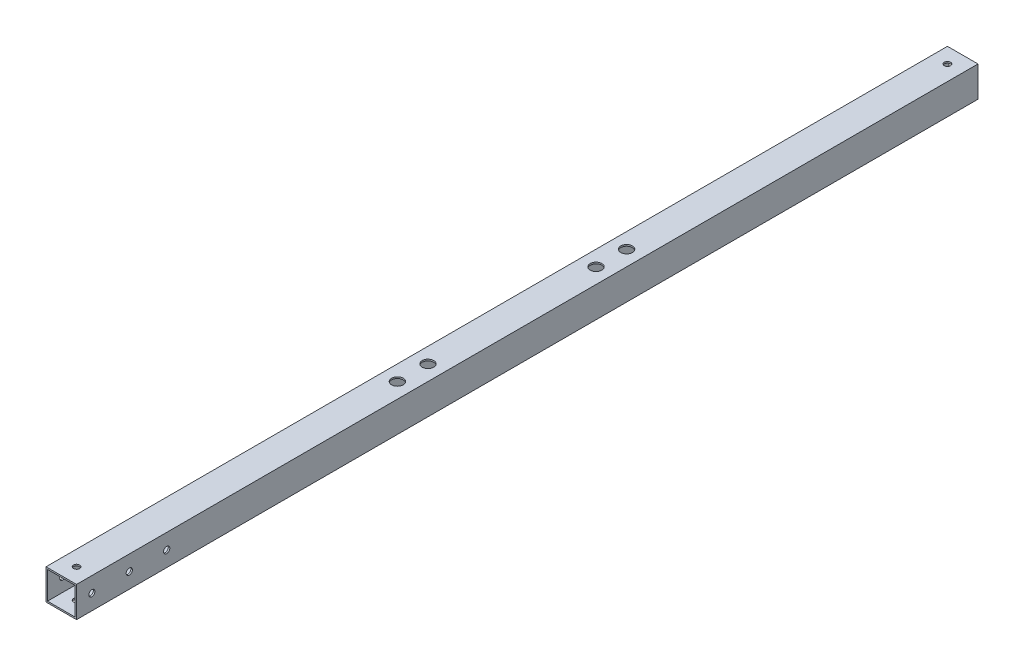
ISO-10303-21;
HEADER;
FILE_DESCRIPTION(('STEP AP214'),'2;1');
FILE_NAME('part.step','',(''),(''),'','','');
FILE_SCHEMA(('AUTOMOTIVE_DESIGN { 1 0 10303 214 1 1 1 1 }'));
ENDSEC;
DATA;
#1=APPLICATION_CONTEXT('core data for automotive mechanical design processes');
#2=APPLICATION_PROTOCOL_DEFINITION('international standard','automotive_design',2000,#1);
#3=PRODUCT_CONTEXT('',#1,'mechanical');
#4=PRODUCT('Part','Part','',(#3));
#5=PRODUCT_RELATED_PRODUCT_CATEGORY('part','',(#4));
#6=PRODUCT_DEFINITION_FORMATION('','',#4);
#7=PRODUCT_DEFINITION_CONTEXT('part definition',#1,'design');
#8=PRODUCT_DEFINITION('design','',#6,#7);
#9=PRODUCT_DEFINITION_SHAPE('','',#8);
#10=(LENGTH_UNIT() NAMED_UNIT(*) SI_UNIT(.MILLI.,.METRE.));
#11=(NAMED_UNIT(*) PLANE_ANGLE_UNIT() SI_UNIT($,.RADIAN.));
#12=(NAMED_UNIT(*) SI_UNIT($,.STERADIAN.) SOLID_ANGLE_UNIT());
#13=UNCERTAINTY_MEASURE_WITH_UNIT(LENGTH_MEASURE(1.E-05),#10,'distance_accuracy_value','');
#14=(GEOMETRIC_REPRESENTATION_CONTEXT(3) GLOBAL_UNCERTAINTY_ASSIGNED_CONTEXT((#13)) GLOBAL_UNIT_ASSIGNED_CONTEXT((#10,
#11,#12)) REPRESENTATION_CONTEXT('',''));
#15=CARTESIAN_POINT('',(0.,0.,0.));
#16=DIRECTION('',(0.,0.,1.));
#17=DIRECTION('',(1.,0.,0.));
#18=AXIS2_PLACEMENT_3D('',#15,#16,#17);
#19=CARTESIAN_POINT('',(0.,0.,295.));
#20=DIRECTION('',(0.,0.,-1.));
#21=DIRECTION('',(-1.,0.,0.));
#22=AXIS2_PLACEMENT_3D('',#19,#20,#21);
#23=PLANE('',#22);
#24=DIRECTION('',(0.,1.,0.));
#25=VECTOR('',#24,1.);
#26=CARTESIAN_POINT('',(10.,-10.,295.));
#27=LINE('',#26,#25);
#28=CARTESIAN_POINT('',(10.,-10.,295.));
#29=VERTEX_POINT('',#28);
#30=CARTESIAN_POINT('',(10.,10.,295.));
#31=VERTEX_POINT('',#30);
#32=EDGE_CURVE('E141',#29,#31,#27,.T.);
#33=ORIENTED_EDGE('',*,*,#32,.T.);
#34=DIRECTION('',(-1.,0.,0.));
#35=VECTOR('',#34,1.);
#36=CARTESIAN_POINT('',(-10.,10.,295.));
#37=LINE('',#36,#35);
#38=CARTESIAN_POINT('',(-10.,10.,295.));
#39=VERTEX_POINT('',#38);
#40=EDGE_CURVE('E144',#31,#39,#37,.T.);
#41=ORIENTED_EDGE('',*,*,#40,.T.);
#42=DIRECTION('',(0.,-1.,0.));
#43=VECTOR('',#42,1.);
#44=CARTESIAN_POINT('',(-10.,-10.,295.));
#45=LINE('',#44,#43);
#46=CARTESIAN_POINT('',(-10.,-10.,295.));
#47=VERTEX_POINT('',#46);
#48=EDGE_CURVE('E147',#39,#47,#45,.T.);
#49=ORIENTED_EDGE('',*,*,#48,.T.);
#50=DIRECTION('',(1.,0.,0.));
#51=VECTOR('',#50,1.);
#52=CARTESIAN_POINT('',(-10.,-10.,295.));
#53=LINE('',#52,#51);
#54=EDGE_CURVE('E149',#47,#29,#53,.T.);
#55=ORIENTED_EDGE('',*,*,#54,.T.);
#56=EDGE_LOOP('',(#33,#41,#49,#55));
#57=FACE_BOUND('',#56,.T.);
#58=DIRECTION('',(1.,0.,0.));
#59=VECTOR('',#58,1.);
#60=CARTESIAN_POINT('',(-9.,-9.,295.));
#61=LINE('',#60,#59);
#62=CARTESIAN_POINT('',(-9.,-9.,295.));
#63=VERTEX_POINT('',#62);
#64=CARTESIAN_POINT('',(9.,-9.,295.));
#65=VERTEX_POINT('',#64);
#66=EDGE_CURVE('E103',#63,#65,#61,.T.);
#67=ORIENTED_EDGE('',*,*,#66,.F.);
#68=DIRECTION('',(0.,-1.,0.));
#69=VECTOR('',#68,1.);
#70=CARTESIAN_POINT('',(-9.,-9.,295.));
#71=LINE('',#70,#69);
#72=CARTESIAN_POINT('',(-9.,9.,295.));
#73=VERTEX_POINT('',#72);
#74=EDGE_CURVE('E125',#73,#63,#71,.T.);
#75=ORIENTED_EDGE('',*,*,#74,.F.);
#76=DIRECTION('',(-1.,0.,0.));
#77=VECTOR('',#76,1.);
#78=CARTESIAN_POINT('',(-9.,9.,295.));
#79=LINE('',#78,#77);
#80=CARTESIAN_POINT('',(9.,9.,295.));
#81=VERTEX_POINT('',#80);
#82=EDGE_CURVE('E123',#81,#73,#79,.T.);
#83=ORIENTED_EDGE('',*,*,#82,.F.);
#84=DIRECTION('',(0.,1.,0.));
#85=VECTOR('',#84,1.);
#86=CARTESIAN_POINT('',(9.,-9.,295.));
#87=LINE('',#86,#85);
#88=EDGE_CURVE('E111',#65,#81,#87,.T.);
#89=ORIENTED_EDGE('',*,*,#88,.F.);
#90=EDGE_LOOP('',(#67,#75,#83,#89));
#91=FACE_BOUND('',#90,.T.);
#92=ADVANCED_FACE('F36',(#57,#91),#23,.F.);
#93=CARTESIAN_POINT('',(0.,0.,-295.));
#94=DIRECTION('',(0.,0.,-1.));
#95=DIRECTION('',(-1.,0.,0.));
#96=AXIS2_PLACEMENT_3D('',#93,#94,#95);
#97=PLANE('',#96);
#98=DIRECTION('',(0.,1.,0.));
#99=VECTOR('',#98,1.);
#100=CARTESIAN_POINT('',(10.,-10.,-295.));
#101=LINE('',#100,#99);
#102=CARTESIAN_POINT('',(10.,-10.,-295.));
#103=VERTEX_POINT('',#102);
#104=CARTESIAN_POINT('',(10.,10.,-295.));
#105=VERTEX_POINT('',#104);
#106=EDGE_CURVE('E119',#103,#105,#101,.T.);
#107=ORIENTED_EDGE('',*,*,#106,.F.);
#108=DIRECTION('',(1.,0.,0.));
#109=VECTOR('',#108,1.);
#110=CARTESIAN_POINT('',(-10.,-10.,-295.));
#111=LINE('',#110,#109);
#112=CARTESIAN_POINT('',(-10.,-10.,-295.));
#113=VERTEX_POINT('',#112);
#114=EDGE_CURVE('E145',#113,#103,#111,.T.);
#115=ORIENTED_EDGE('',*,*,#114,.F.);
#116=DIRECTION('',(0.,-1.,0.));
#117=VECTOR('',#116,1.);
#118=CARTESIAN_POINT('',(-10.,-10.,-295.));
#119=LINE('',#118,#117);
#120=CARTESIAN_POINT('',(-10.,10.,-295.));
#121=VERTEX_POINT('',#120);
#122=EDGE_CURVE('E156',#121,#113,#119,.T.);
#123=ORIENTED_EDGE('',*,*,#122,.F.);
#124=DIRECTION('',(-1.,0.,0.));
#125=VECTOR('',#124,1.);
#126=CARTESIAN_POINT('',(-10.,10.,-295.));
#127=LINE('',#126,#125);
#128=EDGE_CURVE('E154',#105,#121,#127,.T.);
#129=ORIENTED_EDGE('',*,*,#128,.F.);
#130=EDGE_LOOP('',(#107,#115,#123,#129));
#131=FACE_BOUND('',#130,.T.);
#132=DIRECTION('',(0.,-1.,0.));
#133=VECTOR('',#132,1.);
#134=CARTESIAN_POINT('',(-9.,-9.,-295.));
#135=LINE('',#134,#133);
#136=CARTESIAN_POINT('',(-9.,9.,-295.));
#137=VERTEX_POINT('',#136);
#138=CARTESIAN_POINT('',(-9.,-9.,-295.));
#139=VERTEX_POINT('',#138);
#140=EDGE_CURVE('E112',#137,#139,#135,.T.);
#141=ORIENTED_EDGE('',*,*,#140,.T.);
#142=DIRECTION('',(1.,0.,0.));
#143=VECTOR('',#142,1.);
#144=CARTESIAN_POINT('',(-9.,-9.,-295.));
#145=LINE('',#144,#143);
#146=CARTESIAN_POINT('',(9.,-9.,-295.));
#147=VERTEX_POINT('',#146);
#148=EDGE_CURVE('E61',#139,#147,#145,.T.);
#149=ORIENTED_EDGE('',*,*,#148,.T.);
#150=DIRECTION('',(0.,1.,0.));
#151=VECTOR('',#150,1.);
#152=CARTESIAN_POINT('',(9.,-9.,-295.));
#153=LINE('',#152,#151);
#154=CARTESIAN_POINT('',(9.,9.,-295.));
#155=VERTEX_POINT('',#154);
#156=EDGE_CURVE('E118',#147,#155,#153,.T.);
#157=ORIENTED_EDGE('',*,*,#156,.T.);
#158=DIRECTION('',(-1.,0.,0.));
#159=VECTOR('',#158,1.);
#160=CARTESIAN_POINT('',(-9.,9.,-295.));
#161=LINE('',#160,#159);
#162=EDGE_CURVE('E133',#155,#137,#161,.T.);
#163=ORIENTED_EDGE('',*,*,#162,.T.);
#164=EDGE_LOOP('',(#141,#149,#157,#163));
#165=FACE_BOUND('',#164,.T.);
#166=ADVANCED_FACE('F289',(#131,#165),#97,.T.);
#167=CARTESIAN_POINT('',(10.,-10.,295.));
#168=DIRECTION('',(-1.,0.,0.));
#169=DIRECTION('',(0.,-1.,0.));
#170=AXIS2_PLACEMENT_3D('',#167,#168,#169);
#171=PLANE('',#170);
#172=CARTESIAN_POINT('',(10.,0.,236.));
#173=DIRECTION('',(1.,0.,0.));
#174=DIRECTION('',(0.,1.,0.));
#175=AXIS2_PLACEMENT_3D('',#172,#173,#174);
#176=CIRCLE('',#175,2.02500000000005);
#177=CARTESIAN_POINT('',(10.,2.02500000000009,236.));
#178=VERTEX_POINT('',#177);
#179=EDGE_CURVE('E187',#178,#178,#176,.T.);
#180=ORIENTED_EDGE('',*,*,#179,.F.);
#181=EDGE_LOOP('',(#180));
#182=FACE_BOUND('',#181,.T.);
#183=CARTESIAN_POINT('',(10.,0.,260.5));
#184=DIRECTION('',(1.,0.,0.));
#185=DIRECTION('',(0.,1.,0.));
#186=AXIS2_PLACEMENT_3D('',#183,#184,#185);
#187=CIRCLE('',#186,2.02500000000005);
#188=CARTESIAN_POINT('',(10.,2.02500000000008,260.5));
#189=VERTEX_POINT('',#188);
#190=EDGE_CURVE('E221',#189,#189,#187,.T.);
#191=ORIENTED_EDGE('',*,*,#190,.F.);
#192=EDGE_LOOP('',(#191));
#193=FACE_BOUND('',#192,.T.);
#194=CARTESIAN_POINT('',(10.,0.,285.));
#195=DIRECTION('',(1.,0.,0.));
#196=DIRECTION('',(0.,1.,0.));
#197=AXIS2_PLACEMENT_3D('',#194,#195,#196);
#198=CIRCLE('',#197,2.02500000000005);
#199=CARTESIAN_POINT('',(10.,2.02500000000009,285.));
#200=VERTEX_POINT('',#199);
#201=EDGE_CURVE('E218',#200,#200,#198,.T.);
#202=ORIENTED_EDGE('',*,*,#201,.F.);
#203=EDGE_LOOP('',(#202));
#204=FACE_BOUND('',#203,.T.);
#205=ORIENTED_EDGE('',*,*,#106,.T.);
#206=DIRECTION('',(0.,0.,-1.));
#207=VECTOR('',#206,1.);
#208=CARTESIAN_POINT('',(10.,10.,295.));
#209=LINE('',#208,#207);
#210=EDGE_CURVE('E11',#31,#105,#209,.T.);
#211=ORIENTED_EDGE('',*,*,#210,.F.);
#212=ORIENTED_EDGE('',*,*,#32,.F.);
#213=DIRECTION('',(0.,0.,-1.));
#214=VECTOR('',#213,1.);
#215=CARTESIAN_POINT('',(10.,-10.,295.));
#216=LINE('',#215,#214);
#217=EDGE_CURVE('E151',#29,#103,#216,.T.);
#218=ORIENTED_EDGE('',*,*,#217,.T.);
#219=EDGE_LOOP('',(#205,#211,#212,#218));
#220=FACE_BOUND('',#219,.T.);
#221=ADVANCED_FACE('F38',(#182,#193,#204,#220),#171,.F.);
#222=CARTESIAN_POINT('',(-10.,10.,295.));
#223=DIRECTION('',(0.,-1.,0.));
#224=DIRECTION('',(1.,0.,0.));
#225=AXIS2_PLACEMENT_3D('',#222,#223,#224);
#226=PLANE('',#225);
#227=CARTESIAN_POINT('',(0.,10.,-285.));
#228=DIRECTION('',(0.,-1.,0.));
#229=DIRECTION('',(1.,0.,0.));
#230=AXIS2_PLACEMENT_3D('',#227,#228,#229);
#231=CIRCLE('',#230,2.025);
#232=CARTESIAN_POINT('',(2.025,10.,-285.));
#233=VERTEX_POINT('',#232);
#234=EDGE_CURVE('E207',#233,#233,#231,.F.);
#235=ORIENTED_EDGE('',*,*,#234,.F.);
#236=EDGE_LOOP('',(#235));
#237=FACE_BOUND('',#236,.T.);
#238=CARTESIAN_POINT('',(0.,10.,285.));
#239=DIRECTION('',(0.,-1.,0.));
#240=DIRECTION('',(1.,0.,0.));
#241=AXIS2_PLACEMENT_3D('',#238,#239,#240);
#242=CIRCLE('',#241,2.025);
#243=CARTESIAN_POINT('',(2.025,10.,285.));
#244=VERTEX_POINT('',#243);
#245=EDGE_CURVE('E204',#244,#244,#242,.T.);
#246=ORIENTED_EDGE('',*,*,#245,.T.);
#247=EDGE_LOOP('',(#246));
#248=FACE_BOUND('',#247,.T.);
#249=CARTESIAN_POINT('',(-1.11889664200504E-13,10.,-75.));
#250=DIRECTION('',(0.,-1.,0.));
#251=DIRECTION('',(1.,0.,0.));
#252=AXIS2_PLACEMENT_3D('',#249,#250,#251);
#253=CIRCLE('',#252,3.8);
#254=CARTESIAN_POINT('',(3.79999999999989,10.,-75.));
#255=VERTEX_POINT('',#254);
#256=EDGE_CURVE('E182',#255,#255,#253,.T.);
#257=ORIENTED_EDGE('',*,*,#256,.T.);
#258=EDGE_LOOP('',(#257));
#259=FACE_BOUND('',#258,.T.);
#260=CARTESIAN_POINT('',(-1.11889664200504E-13,10.,-55.));
#261=DIRECTION('',(0.,-1.,0.));
#262=DIRECTION('',(1.,0.,0.));
#263=AXIS2_PLACEMENT_3D('',#260,#261,#262);
#264=CIRCLE('',#263,3.8);
#265=CARTESIAN_POINT('',(3.79999999999989,10.,-55.));
#266=VERTEX_POINT('',#265);
#267=EDGE_CURVE('E178',#266,#266,#264,.T.);
#268=ORIENTED_EDGE('',*,*,#267,.T.);
#269=EDGE_LOOP('',(#268));
#270=FACE_BOUND('',#269,.T.);
#271=CARTESIAN_POINT('',(0.,10.,55.));
#272=DIRECTION('',(0.,-1.,0.));
#273=DIRECTION('',(1.,0.,0.));
#274=AXIS2_PLACEMENT_3D('',#271,#272,#273);
#275=CIRCLE('',#274,3.8);
#276=CARTESIAN_POINT('',(3.8,10.,55.));
#277=VERTEX_POINT('',#276);
#278=EDGE_CURVE('E174',#277,#277,#275,.T.);
#279=ORIENTED_EDGE('',*,*,#278,.T.);
#280=EDGE_LOOP('',(#279));
#281=FACE_BOUND('',#280,.T.);
#282=CARTESIAN_POINT('',(0.,10.,75.));
#283=DIRECTION('',(0.,-1.,0.));
#284=DIRECTION('',(1.,0.,0.));
#285=AXIS2_PLACEMENT_3D('',#282,#283,#284);
#286=CIRCLE('',#285,3.8);
#287=CARTESIAN_POINT('',(3.8,10.,75.));
#288=VERTEX_POINT('',#287);
#289=EDGE_CURVE('E169',#288,#288,#286,.T.);
#290=ORIENTED_EDGE('',*,*,#289,.T.);
#291=EDGE_LOOP('',(#290));
#292=FACE_BOUND('',#291,.T.);
#293=ORIENTED_EDGE('',*,*,#128,.T.);
#294=DIRECTION('',(0.,0.,-1.));
#295=VECTOR('',#294,1.);
#296=CARTESIAN_POINT('',(-10.,10.,295.));
#297=LINE('',#296,#295);
#298=EDGE_CURVE('E45',#39,#121,#297,.T.);
#299=ORIENTED_EDGE('',*,*,#298,.F.);
#300=ORIENTED_EDGE('',*,*,#40,.F.);
#301=ORIENTED_EDGE('',*,*,#210,.T.);
#302=EDGE_LOOP('',(#293,#299,#300,#301));
#303=FACE_BOUND('',#302,.T.);
#304=ADVANCED_FACE('F305',(#237,#248,#259,#270,#281,#292,#303),#226,.F.);
#305=CARTESIAN_POINT('',(-10.,-10.,295.));
#306=DIRECTION('',(1.,0.,0.));
#307=DIRECTION('',(0.,0.,-1.));
#308=AXIS2_PLACEMENT_3D('',#305,#306,#307);
#309=PLANE('',#308);
#310=CARTESIAN_POINT('',(-10.,0.,236.));
#311=DIRECTION('',(1.,0.,0.));
#312=DIRECTION('',(0.,0.,-1.));
#313=AXIS2_PLACEMENT_3D('',#310,#311,#312);
#314=CIRCLE('',#313,2.02500000000005);
#315=CARTESIAN_POINT('',(-10.,0.,233.975));
#316=VERTEX_POINT('',#315);
#317=EDGE_CURVE('E170',#316,#316,#314,.T.);
#318=ORIENTED_EDGE('',*,*,#317,.T.);
#319=EDGE_LOOP('',(#318));
#320=FACE_BOUND('',#319,.T.);
#321=CARTESIAN_POINT('',(-10.,0.,260.5));
#322=DIRECTION('',(1.,0.,0.));
#323=DIRECTION('',(0.,0.,-1.));
#324=AXIS2_PLACEMENT_3D('',#321,#322,#323);
#325=CIRCLE('',#324,2.02500000000005);
#326=CARTESIAN_POINT('',(-10.,0.,258.475));
#327=VERTEX_POINT('',#326);
#328=EDGE_CURVE('E196',#327,#327,#325,.T.);
#329=ORIENTED_EDGE('',*,*,#328,.T.);
#330=EDGE_LOOP('',(#329));
#331=FACE_BOUND('',#330,.T.);
#332=CARTESIAN_POINT('',(-10.,0.,285.));
#333=DIRECTION('',(1.,0.,0.));
#334=DIRECTION('',(0.,0.,-1.));
#335=AXIS2_PLACEMENT_3D('',#332,#333,#334);
#336=CIRCLE('',#335,2.02500000000005);
#337=CARTESIAN_POINT('',(-10.,0.,282.975));
#338=VERTEX_POINT('',#337);
#339=EDGE_CURVE('E192',#338,#338,#336,.T.);
#340=ORIENTED_EDGE('',*,*,#339,.T.);
#341=EDGE_LOOP('',(#340));
#342=FACE_BOUND('',#341,.T.);
#343=ORIENTED_EDGE('',*,*,#122,.T.);
#344=DIRECTION('',(0.,0.,-1.));
#345=VECTOR('',#344,1.);
#346=CARTESIAN_POINT('',(-10.,-10.,295.));
#347=LINE('',#346,#345);
#348=EDGE_CURVE('E161',#47,#113,#347,.T.);
#349=ORIENTED_EDGE('',*,*,#348,.F.);
#350=ORIENTED_EDGE('',*,*,#48,.F.);
#351=ORIENTED_EDGE('',*,*,#298,.T.);
#352=EDGE_LOOP('',(#343,#349,#350,#351));
#353=FACE_BOUND('',#352,.T.);
#354=ADVANCED_FACE('F302',(#320,#331,#342,#353),#309,.F.);
#355=CARTESIAN_POINT('',(-10.,-10.,295.));
#356=DIRECTION('',(0.,1.,0.));
#357=DIRECTION('',(-1.,0.,0.));
#358=AXIS2_PLACEMENT_3D('',#355,#356,#357);
#359=PLANE('',#358);
#360=CARTESIAN_POINT('',(0.,-10.,-285.));
#361=DIRECTION('',(0.,1.,0.));
#362=DIRECTION('',(1.,0.,0.));
#363=AXIS2_PLACEMENT_3D('',#360,#361,#362);
#364=CIRCLE('',#363,2.025);
#365=CARTESIAN_POINT('',(2.02499999999999,-10.,-285.));
#366=VERTEX_POINT('',#365);
#367=EDGE_CURVE('E556',#366,#366,#364,.T.);
#368=ORIENTED_EDGE('',*,*,#367,.T.);
#369=EDGE_LOOP('',(#368));
#370=FACE_BOUND('',#369,.T.);
#371=CARTESIAN_POINT('',(0.,-10.,285.));
#372=DIRECTION('',(0.,-1.,0.));
#373=DIRECTION('',(1.,0.,0.));
#374=AXIS2_PLACEMENT_3D('',#371,#372,#373);
#375=CIRCLE('',#374,2.025);
#376=CARTESIAN_POINT('',(2.02499999999999,-10.,285.));
#377=VERTEX_POINT('',#376);
#378=EDGE_CURVE('E200',#377,#377,#375,.T.);
#379=ORIENTED_EDGE('',*,*,#378,.F.);
#380=EDGE_LOOP('',(#379));
#381=FACE_BOUND('',#380,.T.);
#382=CARTESIAN_POINT('',(0.,-10.,75.));
#383=DIRECTION('',(0.,1.,0.));
#384=DIRECTION('',(-1.,0.,0.));
#385=AXIS2_PLACEMENT_3D('',#382,#383,#384);
#386=CIRCLE('',#385,2.02499999999997);
#387=CARTESIAN_POINT('',(-2.02499999999997,-10.,75.));
#388=VERTEX_POINT('',#387);
#389=EDGE_CURVE('E131',#388,#388,#386,.T.);
#390=ORIENTED_EDGE('',*,*,#389,.T.);
#391=EDGE_LOOP('',(#390));
#392=FACE_BOUND('',#391,.T.);
#393=CARTESIAN_POINT('',(0.,-10.,55.));
#394=DIRECTION('',(0.,1.,0.));
#395=DIRECTION('',(-1.,0.,0.));
#396=AXIS2_PLACEMENT_3D('',#393,#394,#395);
#397=CIRCLE('',#396,2.02499999999999);
#398=CARTESIAN_POINT('',(-2.02499999999999,-10.,55.));
#399=VERTEX_POINT('',#398);
#400=EDGE_CURVE('E261',#399,#399,#397,.T.);
#401=ORIENTED_EDGE('',*,*,#400,.T.);
#402=EDGE_LOOP('',(#401));
#403=FACE_BOUND('',#402,.T.);
#404=CARTESIAN_POINT('',(-1.65666091955785E-13,-10.,-55.));
#405=DIRECTION('',(0.,1.,0.));
#406=DIRECTION('',(-1.,0.,0.));
#407=AXIS2_PLACEMENT_3D('',#404,#405,#406);
#408=CIRCLE('',#407,2.02500000000004);
#409=CARTESIAN_POINT('',(-2.0250000000002,-10.,-55.));
#410=VERTEX_POINT('',#409);
#411=EDGE_CURVE('E255',#410,#410,#408,.T.);
#412=ORIENTED_EDGE('',*,*,#411,.T.);
#413=EDGE_LOOP('',(#412));
#414=FACE_BOUND('',#413,.T.);
#415=CARTESIAN_POINT('',(-1.65666091955785E-13,-10.,-75.));
#416=DIRECTION('',(0.,1.,0.));
#417=DIRECTION('',(-1.,0.,0.));
#418=AXIS2_PLACEMENT_3D('',#415,#416,#417);
#419=CIRCLE('',#418,2.02500000000004);
#420=CARTESIAN_POINT('',(-2.02500000000021,-10.,-75.));
#421=VERTEX_POINT('',#420);
#422=EDGE_CURVE('E249',#421,#421,#419,.T.);
#423=ORIENTED_EDGE('',*,*,#422,.T.);
#424=EDGE_LOOP('',(#423));
#425=FACE_BOUND('',#424,.T.);
#426=ORIENTED_EDGE('',*,*,#114,.T.);
#427=ORIENTED_EDGE('',*,*,#217,.F.);
#428=ORIENTED_EDGE('',*,*,#54,.F.);
#429=ORIENTED_EDGE('',*,*,#348,.T.);
#430=EDGE_LOOP('',(#426,#427,#428,#429));
#431=FACE_BOUND('',#430,.T.);
#432=ADVANCED_FACE('F269',(#370,#381,#392,#403,#414,#425,#431),#359,.F.);
#433=CARTESIAN_POINT('',(-9.,-9.,295.));
#434=DIRECTION('',(0.,1.,0.));
#435=DIRECTION('',(0.,0.,1.));
#436=AXIS2_PLACEMENT_3D('',#433,#434,#435);
#437=PLANE('',#436);
#438=CARTESIAN_POINT('',(0.,-9.,-285.));
#439=DIRECTION('',(0.,1.,0.));
#440=DIRECTION('',(0.,0.,1.));
#441=AXIS2_PLACEMENT_3D('',#438,#439,#440);
#442=CIRCLE('',#441,2.025);
#443=CARTESIAN_POINT('',(0.,-9.,-282.975));
#444=VERTEX_POINT('',#443);
#445=EDGE_CURVE('E212',#444,#444,#442,.F.);
#446=ORIENTED_EDGE('',*,*,#445,.T.);
#447=EDGE_LOOP('',(#446));
#448=FACE_BOUND('',#447,.T.);
#449=CARTESIAN_POINT('',(0.,-9.,285.));
#450=DIRECTION('',(0.,1.,0.));
#451=DIRECTION('',(0.,0.,1.));
#452=AXIS2_PLACEMENT_3D('',#449,#450,#451);
#453=CIRCLE('',#452,2.025);
#454=CARTESIAN_POINT('',(0.,-9.,287.025));
#455=VERTEX_POINT('',#454);
#456=EDGE_CURVE('E199',#455,#455,#453,.T.);
#457=ORIENTED_EDGE('',*,*,#456,.F.);
#458=EDGE_LOOP('',(#457));
#459=FACE_BOUND('',#458,.T.);
#460=CARTESIAN_POINT('',(0.,-9.,75.));
#461=DIRECTION('',(0.,1.,0.));
#462=DIRECTION('',(0.,0.,1.));
#463=AXIS2_PLACEMENT_3D('',#460,#461,#462);
#464=CIRCLE('',#463,2.02499999999997);
#465=CARTESIAN_POINT('',(0.,-9.,77.0249999999999));
#466=VERTEX_POINT('',#465);
#467=EDGE_CURVE('E264',#466,#466,#464,.T.);
#468=ORIENTED_EDGE('',*,*,#467,.F.);
#469=EDGE_LOOP('',(#468));
#470=FACE_BOUND('',#469,.T.);
#471=CARTESIAN_POINT('',(0.,-9.,55.));
#472=DIRECTION('',(0.,1.,0.));
#473=DIRECTION('',(0.,0.,1.));
#474=AXIS2_PLACEMENT_3D('',#471,#472,#473);
#475=CIRCLE('',#474,2.02499999999999);
#476=CARTESIAN_POINT('',(0.,-9.,57.0249999999999));
#477=VERTEX_POINT('',#476);
#478=EDGE_CURVE('E258',#477,#477,#475,.T.);
#479=ORIENTED_EDGE('',*,*,#478,.F.);
#480=EDGE_LOOP('',(#479));
#481=FACE_BOUND('',#480,.T.);
#482=CARTESIAN_POINT('',(-1.65752828129584E-13,-9.,-55.));
#483=DIRECTION('',(0.,1.,0.));
#484=DIRECTION('',(0.,0.,1.));
#485=AXIS2_PLACEMENT_3D('',#482,#483,#484);
#486=CIRCLE('',#485,2.02500000000004);
#487=CARTESIAN_POINT('',(-1.65752828129584E-13,-9.,-52.975));
#488=VERTEX_POINT('',#487);
#489=EDGE_CURVE('E252',#488,#488,#486,.T.);
#490=ORIENTED_EDGE('',*,*,#489,.F.);
#491=EDGE_LOOP('',(#490));
#492=FACE_BOUND('',#491,.T.);
#493=CARTESIAN_POINT('',(-1.65752828129584E-13,-9.,-75.));
#494=DIRECTION('',(0.,1.,0.));
#495=DIRECTION('',(0.,0.,1.));
#496=AXIS2_PLACEMENT_3D('',#493,#494,#495);
#497=CIRCLE('',#496,2.02500000000004);
#498=CARTESIAN_POINT('',(-1.65752828129584E-13,-9.,-72.975));
#499=VERTEX_POINT('',#498);
#500=EDGE_CURVE('E246',#499,#499,#497,.T.);
#501=ORIENTED_EDGE('',*,*,#500,.F.);
#502=EDGE_LOOP('',(#501));
#503=FACE_BOUND('',#502,.T.);
#504=ORIENTED_EDGE('',*,*,#148,.F.);
#505=DIRECTION('',(0.,0.,-1.));
#506=VECTOR('',#505,1.);
#507=CARTESIAN_POINT('',(-9.,-9.,295.));
#508=LINE('',#507,#506);
#509=EDGE_CURVE('E107',#63,#139,#508,.T.);
#510=ORIENTED_EDGE('',*,*,#509,.F.);
#511=ORIENTED_EDGE('',*,*,#66,.T.);
#512=DIRECTION('',(0.,0.,-1.));
#513=VECTOR('',#512,1.);
#514=CARTESIAN_POINT('',(9.,-9.,295.));
#515=LINE('',#514,#513);
#516=EDGE_CURVE('E106',#65,#147,#515,.T.);
#517=ORIENTED_EDGE('',*,*,#516,.T.);
#518=EDGE_LOOP('',(#504,#510,#511,#517));
#519=FACE_BOUND('',#518,.T.);
#520=ADVANCED_FACE('F105',(#448,#459,#470,#481,#492,#503,#519),#437,.T.);
#521=CARTESIAN_POINT('',(9.,-9.,295.));
#522=DIRECTION('',(-1.,0.,0.));
#523=DIRECTION('',(0.,-1.,0.));
#524=AXIS2_PLACEMENT_3D('',#521,#522,#523);
#525=PLANE('',#524);
#526=CARTESIAN_POINT('',(8.99999999999999,0.,236.));
#527=DIRECTION('',(-1.,0.,0.));
#528=DIRECTION('',(0.,-1.,0.));
#529=AXIS2_PLACEMENT_3D('',#526,#527,#528);
#530=CIRCLE('',#529,2.02500000000005);
#531=CARTESIAN_POINT('',(8.99999999999999,-2.02500000000002,236.));
#532=VERTEX_POINT('',#531);
#533=EDGE_CURVE('E195',#532,#532,#530,.T.);
#534=ORIENTED_EDGE('',*,*,#533,.F.);
#535=EDGE_LOOP('',(#534));
#536=FACE_BOUND('',#535,.T.);
#537=CARTESIAN_POINT('',(8.99999999999999,0.,260.5));
#538=DIRECTION('',(-1.,0.,0.));
#539=DIRECTION('',(0.,-1.,0.));
#540=AXIS2_PLACEMENT_3D('',#537,#538,#539);
#541=CIRCLE('',#540,2.02500000000005);
#542=CARTESIAN_POINT('',(8.99999999999999,-2.02500000000001,260.5));
#543=VERTEX_POINT('',#542);
#544=EDGE_CURVE('E191',#543,#543,#541,.T.);
#545=ORIENTED_EDGE('',*,*,#544,.F.);
#546=EDGE_LOOP('',(#545));
#547=FACE_BOUND('',#546,.T.);
#548=CARTESIAN_POINT('',(8.99999999999999,0.,285.));
#549=DIRECTION('',(-1.,0.,0.));
#550=DIRECTION('',(0.,-1.,0.));
#551=AXIS2_PLACEMENT_3D('',#548,#549,#550);
#552=CIRCLE('',#551,2.02500000000005);
#553=CARTESIAN_POINT('',(8.99999999999999,-2.02500000000002,285.));
#554=VERTEX_POINT('',#553);
#555=EDGE_CURVE('E186',#554,#554,#552,.T.);
#556=ORIENTED_EDGE('',*,*,#555,.F.);
#557=EDGE_LOOP('',(#556));
#558=FACE_BOUND('',#557,.T.);
#559=ORIENTED_EDGE('',*,*,#156,.F.);
#560=ORIENTED_EDGE('',*,*,#516,.F.);
#561=ORIENTED_EDGE('',*,*,#88,.T.);
#562=DIRECTION('',(0.,0.,-1.));
#563=VECTOR('',#562,1.);
#564=CARTESIAN_POINT('',(9.,9.,295.));
#565=LINE('',#564,#563);
#566=EDGE_CURVE('E120',#81,#155,#565,.T.);
#567=ORIENTED_EDGE('',*,*,#566,.T.);
#568=EDGE_LOOP('',(#559,#560,#561,#567));
#569=FACE_BOUND('',#568,.T.);
#570=ADVANCED_FACE('F115',(#536,#547,#558,#569),#525,.T.);
#571=CARTESIAN_POINT('',(-9.,9.,295.));
#572=DIRECTION('',(0.,-1.,0.));
#573=DIRECTION('',(1.,0.,0.));
#574=AXIS2_PLACEMENT_3D('',#571,#572,#573);
#575=PLANE('',#574);
#576=CARTESIAN_POINT('',(0.,9.,-285.));
#577=DIRECTION('',(0.,-1.,0.));
#578=DIRECTION('',(1.,0.,0.));
#579=AXIS2_PLACEMENT_3D('',#576,#577,#578);
#580=CIRCLE('',#579,2.025);
#581=CARTESIAN_POINT('',(2.025,9.,-285.));
#582=VERTEX_POINT('',#581);
#583=EDGE_CURVE('E40',#582,#582,#580,.F.);
#584=ORIENTED_EDGE('',*,*,#583,.T.);
#585=EDGE_LOOP('',(#584));
#586=FACE_BOUND('',#585,.T.);
#587=CARTESIAN_POINT('',(0.,9.,285.));
#588=DIRECTION('',(0.,-1.,0.));
#589=DIRECTION('',(1.,0.,0.));
#590=AXIS2_PLACEMENT_3D('',#587,#588,#589);
#591=CIRCLE('',#590,2.025);
#592=CARTESIAN_POINT('',(2.025,9.,285.));
#593=VERTEX_POINT('',#592);
#594=EDGE_CURVE('E197',#593,#593,#591,.T.);
#595=ORIENTED_EDGE('',*,*,#594,.F.);
#596=EDGE_LOOP('',(#595));
#597=FACE_BOUND('',#596,.T.);
#598=CARTESIAN_POINT('',(-1.11802928026705E-13,9.,-75.));
#599=DIRECTION('',(0.,-1.,0.));
#600=DIRECTION('',(1.,0.,0.));
#601=AXIS2_PLACEMENT_3D('',#598,#599,#600);
#602=CIRCLE('',#601,3.8);
#603=CARTESIAN_POINT('',(3.79999999999989,9.,-75.));
#604=VERTEX_POINT('',#603);
#605=EDGE_CURVE('E179',#604,#604,#602,.T.);
#606=ORIENTED_EDGE('',*,*,#605,.F.);
#607=EDGE_LOOP('',(#606));
#608=FACE_BOUND('',#607,.T.);
#609=CARTESIAN_POINT('',(-1.11802928026705E-13,9.,-55.));
#610=DIRECTION('',(0.,-1.,0.));
#611=DIRECTION('',(1.,0.,0.));
#612=AXIS2_PLACEMENT_3D('',#609,#610,#611);
#613=CIRCLE('',#612,3.8);
#614=CARTESIAN_POINT('',(3.79999999999989,9.,-55.));
#615=VERTEX_POINT('',#614);
#616=EDGE_CURVE('E175',#615,#615,#613,.T.);
#617=ORIENTED_EDGE('',*,*,#616,.F.);
#618=EDGE_LOOP('',(#617));
#619=FACE_BOUND('',#618,.T.);
#620=CARTESIAN_POINT('',(0.,9.,55.));
#621=DIRECTION('',(0.,-1.,0.));
#622=DIRECTION('',(1.,0.,0.));
#623=AXIS2_PLACEMENT_3D('',#620,#621,#622);
#624=CIRCLE('',#623,3.8);
#625=CARTESIAN_POINT('',(3.8,9.,55.));
#626=VERTEX_POINT('',#625);
#627=EDGE_CURVE('E171',#626,#626,#624,.T.);
#628=ORIENTED_EDGE('',*,*,#627,.F.);
#629=EDGE_LOOP('',(#628));
#630=FACE_BOUND('',#629,.T.);
#631=CARTESIAN_POINT('',(0.,9.,75.));
#632=DIRECTION('',(0.,-1.,0.));
#633=DIRECTION('',(1.,0.,0.));
#634=AXIS2_PLACEMENT_3D('',#631,#632,#633);
#635=CIRCLE('',#634,3.8);
#636=CARTESIAN_POINT('',(3.8,9.,75.));
#637=VERTEX_POINT('',#636);
#638=EDGE_CURVE('E166',#637,#637,#635,.T.);
#639=ORIENTED_EDGE('',*,*,#638,.F.);
#640=EDGE_LOOP('',(#639));
#641=FACE_BOUND('',#640,.T.);
#642=ORIENTED_EDGE('',*,*,#162,.F.);
#643=ORIENTED_EDGE('',*,*,#566,.F.);
#644=ORIENTED_EDGE('',*,*,#82,.T.);
#645=DIRECTION('',(0.,0.,-1.));
#646=VECTOR('',#645,1.);
#647=CARTESIAN_POINT('',(-9.,9.,295.));
#648=LINE('',#647,#646);
#649=EDGE_CURVE('E53',#73,#137,#648,.T.);
#650=ORIENTED_EDGE('',*,*,#649,.T.);
#651=EDGE_LOOP('',(#642,#643,#644,#650));
#652=FACE_BOUND('',#651,.T.);
#653=ADVANCED_FACE('F343',(#586,#597,#608,#619,#630,#641,#652),#575,.T.);
#654=CARTESIAN_POINT('',(-9.,-9.,295.));
#655=DIRECTION('',(1.,0.,0.));
#656=DIRECTION('',(0.,0.,-1.));
#657=AXIS2_PLACEMENT_3D('',#654,#655,#656);
#658=PLANE('',#657);
#659=CARTESIAN_POINT('',(-9.,0.,236.));
#660=DIRECTION('',(1.,0.,0.));
#661=DIRECTION('',(0.,0.,-1.));
#662=AXIS2_PLACEMENT_3D('',#659,#660,#661);
#663=CIRCLE('',#662,2.02500000000005);
#664=CARTESIAN_POINT('',(-9.,0.,233.975));
#665=VERTEX_POINT('',#664);
#666=EDGE_CURVE('E193',#665,#665,#663,.T.);
#667=ORIENTED_EDGE('',*,*,#666,.F.);
#668=EDGE_LOOP('',(#667));
#669=FACE_BOUND('',#668,.T.);
#670=CARTESIAN_POINT('',(-9.,0.,260.5));
#671=DIRECTION('',(1.,0.,0.));
#672=DIRECTION('',(0.,0.,-1.));
#673=AXIS2_PLACEMENT_3D('',#670,#671,#672);
#674=CIRCLE('',#673,2.02500000000005);
#675=CARTESIAN_POINT('',(-9.,0.,258.475));
#676=VERTEX_POINT('',#675);
#677=EDGE_CURVE('E188',#676,#676,#674,.T.);
#678=ORIENTED_EDGE('',*,*,#677,.F.);
#679=EDGE_LOOP('',(#678));
#680=FACE_BOUND('',#679,.T.);
#681=CARTESIAN_POINT('',(-9.,0.,285.));
#682=DIRECTION('',(1.,0.,0.));
#683=DIRECTION('',(0.,0.,-1.));
#684=AXIS2_PLACEMENT_3D('',#681,#682,#683);
#685=CIRCLE('',#684,2.02500000000005);
#686=CARTESIAN_POINT('',(-9.,0.,282.975));
#687=VERTEX_POINT('',#686);
#688=EDGE_CURVE('E183',#687,#687,#685,.T.);
#689=ORIENTED_EDGE('',*,*,#688,.F.);
#690=EDGE_LOOP('',(#689));
#691=FACE_BOUND('',#690,.T.);
#692=ORIENTED_EDGE('',*,*,#140,.F.);
#693=ORIENTED_EDGE('',*,*,#649,.F.);
#694=ORIENTED_EDGE('',*,*,#74,.T.);
#695=ORIENTED_EDGE('',*,*,#509,.T.);
#696=EDGE_LOOP('',(#692,#693,#694,#695));
#697=FACE_BOUND('',#696,.T.);
#698=ADVANCED_FACE('F340',(#669,#680,#691,#697),#658,.T.);
#699=CARTESIAN_POINT('',(-1.63497687610814E-13,-35.,-75.));
#700=DIRECTION('',(0.,1.,0.));
#701=DIRECTION('',(-1.,0.,0.));
#702=AXIS2_PLACEMENT_3D('',#699,#700,#701);
#703=CYLINDRICAL_SURFACE('',#702,2.02500000000004);
#704=ORIENTED_EDGE('',*,*,#500,.T.);
#705=EDGE_LOOP('',(#704));
#706=FACE_BOUND('',#705,.T.);
#707=ORIENTED_EDGE('',*,*,#422,.F.);
#708=EDGE_LOOP('',(#707));
#709=FACE_BOUND('',#708,.T.);
#710=ADVANCED_FACE('F342',(#706,#709),#703,.F.);
#711=CARTESIAN_POINT('',(-1.63497687610814E-13,-35.,-55.));
#712=DIRECTION('',(0.,1.,0.));
#713=DIRECTION('',(-1.,0.,0.));
#714=AXIS2_PLACEMENT_3D('',#711,#712,#713);
#715=CYLINDRICAL_SURFACE('',#714,2.02500000000004);
#716=ORIENTED_EDGE('',*,*,#489,.T.);
#717=EDGE_LOOP('',(#716));
#718=FACE_BOUND('',#717,.T.);
#719=ORIENTED_EDGE('',*,*,#411,.F.);
#720=EDGE_LOOP('',(#719));
#721=FACE_BOUND('',#720,.T.);
#722=ADVANCED_FACE('F285',(#718,#721),#715,.F.);
#723=CARTESIAN_POINT('',(0.,-35.,55.));
#724=DIRECTION('',(0.,1.,0.));
#725=DIRECTION('',(-1.,0.,0.));
#726=AXIS2_PLACEMENT_3D('',#723,#724,#725);
#727=CYLINDRICAL_SURFACE('',#726,2.02499999999999);
#728=ORIENTED_EDGE('',*,*,#478,.T.);
#729=EDGE_LOOP('',(#728));
#730=FACE_BOUND('',#729,.T.);
#731=ORIENTED_EDGE('',*,*,#400,.F.);
#732=EDGE_LOOP('',(#731));
#733=FACE_BOUND('',#732,.T.);
#734=ADVANCED_FACE('F275',(#730,#733),#727,.F.);
#735=CARTESIAN_POINT('',(0.,-35.,75.));
#736=DIRECTION('',(0.,1.,0.));
#737=DIRECTION('',(-1.,0.,0.));
#738=AXIS2_PLACEMENT_3D('',#735,#736,#737);
#739=CYLINDRICAL_SURFACE('',#738,2.02499999999997);
#740=ORIENTED_EDGE('',*,*,#467,.T.);
#741=EDGE_LOOP('',(#740));
#742=FACE_BOUND('',#741,.T.);
#743=ORIENTED_EDGE('',*,*,#389,.F.);
#744=EDGE_LOOP('',(#743));
#745=FACE_BOUND('',#744,.T.);
#746=ADVANCED_FACE('F272',(#742,#745),#739,.F.);
#747=CARTESIAN_POINT('',(0.,5.,75.));
#748=DIRECTION('',(0.,1.,0.));
#749=DIRECTION('',(-1.,0.,0.));
#750=AXIS2_PLACEMENT_3D('',#747,#748,#749);
#751=CYLINDRICAL_SURFACE('',#750,3.8);
#752=ORIENTED_EDGE('',*,*,#638,.T.);
#753=EDGE_LOOP('',(#752));
#754=FACE_BOUND('',#753,.T.);
#755=ORIENTED_EDGE('',*,*,#289,.F.);
#756=EDGE_LOOP('',(#755));
#757=FACE_BOUND('',#756,.T.);
#758=ADVANCED_FACE('F274',(#754,#757),#751,.F.);
#759=CARTESIAN_POINT('',(0.,5.,55.));
#760=DIRECTION('',(0.,1.,0.));
#761=DIRECTION('',(-1.,0.,0.));
#762=AXIS2_PLACEMENT_3D('',#759,#760,#761);
#763=CYLINDRICAL_SURFACE('',#762,3.8);
#764=ORIENTED_EDGE('',*,*,#627,.T.);
#765=EDGE_LOOP('',(#764));
#766=FACE_BOUND('',#765,.T.);
#767=ORIENTED_EDGE('',*,*,#278,.F.);
#768=EDGE_LOOP('',(#767));
#769=FACE_BOUND('',#768,.T.);
#770=ADVANCED_FACE('F282',(#766,#769),#763,.F.);
#771=CARTESIAN_POINT('',(-1.1145598333151E-13,5.,-55.));
#772=DIRECTION('',(0.,1.,0.));
#773=DIRECTION('',(-1.,0.,0.));
#774=AXIS2_PLACEMENT_3D('',#771,#772,#773);
#775=CYLINDRICAL_SURFACE('',#774,3.8);
#776=ORIENTED_EDGE('',*,*,#616,.T.);
#777=EDGE_LOOP('',(#776));
#778=FACE_BOUND('',#777,.T.);
#779=ORIENTED_EDGE('',*,*,#267,.F.);
#780=EDGE_LOOP('',(#779));
#781=FACE_BOUND('',#780,.T.);
#782=ADVANCED_FACE('F397',(#778,#781),#775,.F.);
#783=CARTESIAN_POINT('',(-1.1145598333151E-13,5.,-75.));
#784=DIRECTION('',(0.,1.,0.));
#785=DIRECTION('',(-1.,0.,0.));
#786=AXIS2_PLACEMENT_3D('',#783,#784,#785);
#787=CYLINDRICAL_SURFACE('',#786,3.8);
#788=ORIENTED_EDGE('',*,*,#605,.T.);
#789=EDGE_LOOP('',(#788));
#790=FACE_BOUND('',#789,.T.);
#791=ORIENTED_EDGE('',*,*,#256,.F.);
#792=EDGE_LOOP('',(#791));
#793=FACE_BOUND('',#792,.T.);
#794=ADVANCED_FACE('F390',(#790,#793),#787,.F.);
#795=CARTESIAN_POINT('',(-63.,0.,285.));
#796=DIRECTION('',(1.,0.,0.));
#797=DIRECTION('',(0.,1.,0.));
#798=AXIS2_PLACEMENT_3D('',#795,#796,#797);
#799=CYLINDRICAL_SURFACE('',#798,2.02500000000005);
#800=ORIENTED_EDGE('',*,*,#688,.T.);
#801=EDGE_LOOP('',(#800));
#802=FACE_BOUND('',#801,.T.);
#803=ORIENTED_EDGE('',*,*,#339,.F.);
#804=EDGE_LOOP('',(#803));
#805=FACE_BOUND('',#804,.T.);
#806=ADVANCED_FACE('F375',(#802,#805),#799,.F.);
#807=CARTESIAN_POINT('',(-63.,0.,260.5));
#808=DIRECTION('',(1.,0.,0.));
#809=DIRECTION('',(0.,1.,0.));
#810=AXIS2_PLACEMENT_3D('',#807,#808,#809);
#811=CYLINDRICAL_SURFACE('',#810,2.02500000000005);
#812=ORIENTED_EDGE('',*,*,#677,.T.);
#813=EDGE_LOOP('',(#812));
#814=FACE_BOUND('',#813,.T.);
#815=ORIENTED_EDGE('',*,*,#328,.F.);
#816=EDGE_LOOP('',(#815));
#817=FACE_BOUND('',#816,.T.);
#818=ADVANCED_FACE('F385',(#814,#817),#811,.F.);
#819=CARTESIAN_POINT('',(-63.,0.,236.));
#820=DIRECTION('',(1.,0.,0.));
#821=DIRECTION('',(0.,1.,0.));
#822=AXIS2_PLACEMENT_3D('',#819,#820,#821);
#823=CYLINDRICAL_SURFACE('',#822,2.02500000000005);
#824=ORIENTED_EDGE('',*,*,#666,.T.);
#825=EDGE_LOOP('',(#824));
#826=FACE_BOUND('',#825,.T.);
#827=ORIENTED_EDGE('',*,*,#317,.F.);
#828=EDGE_LOOP('',(#827));
#829=FACE_BOUND('',#828,.T.);
#830=ADVANCED_FACE('F373',(#826,#829),#823,.F.);
#831=ORIENTED_EDGE('',*,*,#555,.T.);
#832=EDGE_LOOP('',(#831));
#833=FACE_BOUND('',#832,.T.);
#834=ORIENTED_EDGE('',*,*,#201,.T.);
#835=EDGE_LOOP('',(#834));
#836=FACE_BOUND('',#835,.T.);
#837=ADVANCED_FACE('F369',(#833,#836),#799,.F.);
#838=ORIENTED_EDGE('',*,*,#544,.T.);
#839=EDGE_LOOP('',(#838));
#840=FACE_BOUND('',#839,.T.);
#841=ORIENTED_EDGE('',*,*,#190,.T.);
#842=EDGE_LOOP('',(#841));
#843=FACE_BOUND('',#842,.T.);
#844=ADVANCED_FACE('F372',(#840,#843),#811,.F.);
#845=ORIENTED_EDGE('',*,*,#533,.T.);
#846=EDGE_LOOP('',(#845));
#847=FACE_BOUND('',#846,.T.);
#848=ORIENTED_EDGE('',*,*,#179,.T.);
#849=EDGE_LOOP('',(#848));
#850=FACE_BOUND('',#849,.T.);
#851=ADVANCED_FACE('F382',(#847,#850),#823,.F.);
#852=CARTESIAN_POINT('',(0.,60.,285.));
#853=DIRECTION('',(0.,-1.,0.));
#854=DIRECTION('',(1.,0.,0.));
#855=AXIS2_PLACEMENT_3D('',#852,#853,#854);
#856=CYLINDRICAL_SURFACE('',#855,2.025);
#857=ORIENTED_EDGE('',*,*,#594,.T.);
#858=EDGE_LOOP('',(#857));
#859=FACE_BOUND('',#858,.T.);
#860=ORIENTED_EDGE('',*,*,#245,.F.);
#861=EDGE_LOOP('',(#860));
#862=FACE_BOUND('',#861,.T.);
#863=ADVANCED_FACE('F493',(#859,#862),#856,.F.);
#864=ORIENTED_EDGE('',*,*,#456,.T.);
#865=EDGE_LOOP('',(#864));
#866=FACE_BOUND('',#865,.T.);
#867=ORIENTED_EDGE('',*,*,#378,.T.);
#868=EDGE_LOOP('',(#867));
#869=FACE_BOUND('',#868,.T.);
#870=ADVANCED_FACE('F502',(#866,#869),#856,.F.);
#871=CARTESIAN_POINT('',(0.,60.,-285.));
#872=DIRECTION('',(0.,-1.,0.));
#873=DIRECTION('',(1.,0.,0.));
#874=AXIS2_PLACEMENT_3D('',#871,#872,#873);
#875=CYLINDRICAL_SURFACE('',#874,2.025);
#876=ORIENTED_EDGE('',*,*,#583,.F.);
#877=EDGE_LOOP('',(#876));
#878=FACE_BOUND('',#877,.T.);
#879=ORIENTED_EDGE('',*,*,#234,.T.);
#880=EDGE_LOOP('',(#879));
#881=FACE_BOUND('',#880,.T.);
#882=ADVANCED_FACE('F510',(#878,#881),#875,.F.);
#883=ORIENTED_EDGE('',*,*,#445,.F.);
#884=EDGE_LOOP('',(#883));
#885=FACE_BOUND('',#884,.T.);
#886=ORIENTED_EDGE('',*,*,#367,.F.);
#887=EDGE_LOOP('',(#886));
#888=FACE_BOUND('',#887,.T.);
#889=ADVANCED_FACE('F538',(#885,#888),#875,.F.);
#890=CLOSED_SHELL('',(#92,#166,#221,#304,#354,#432,#520,#570,#653,#698,#710,#722,#734,#746,#758,
#770,#782,#794,#806,#818,#830,#837,#844,#851,#863,#870,#882,#889));
#891=MANIFOLD_SOLID_BREP('B2',#890);
#892=ADVANCED_BREP_SHAPE_REPRESENTATION('',(#18,#891),#14);
#893=SHAPE_DEFINITION_REPRESENTATION(#9,#892);
ENDSEC;
END-ISO-10303-21;
